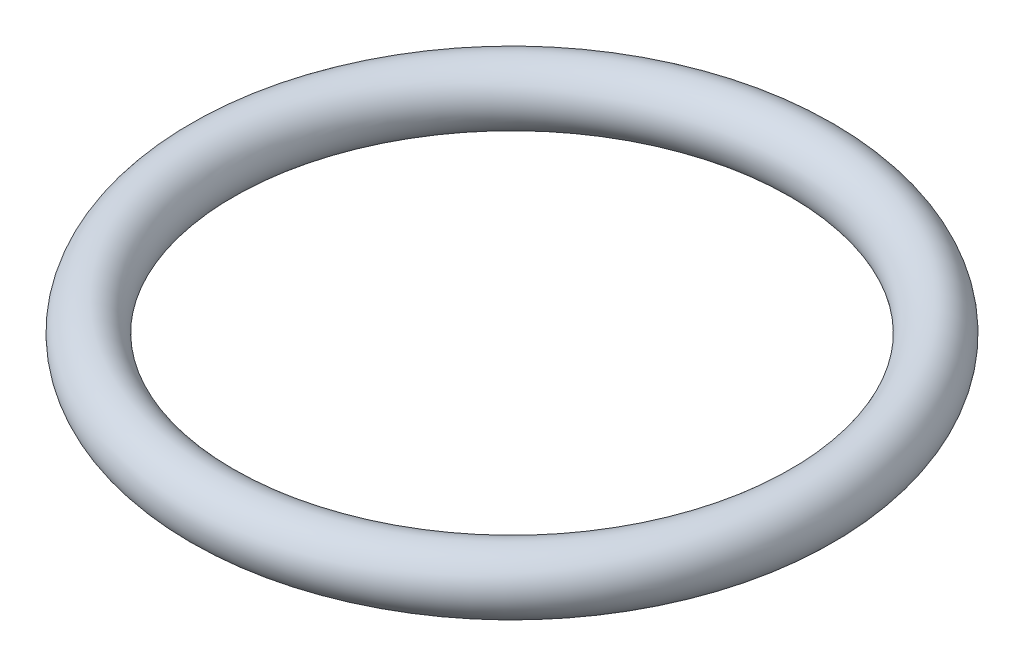
ISO-10303-21;
HEADER;
FILE_DESCRIPTION(('STEP AP214'),'2;1');
FILE_NAME('part.step','',(''),(''),'','','');
FILE_SCHEMA(('AUTOMOTIVE_DESIGN { 1 0 10303 214 1 1 1 1 }'));
ENDSEC;
DATA;
#1=APPLICATION_CONTEXT('core data for automotive mechanical design processes');
#2=APPLICATION_PROTOCOL_DEFINITION('international standard','automotive_design',2000,#1);
#3=PRODUCT_CONTEXT('',#1,'mechanical');
#4=PRODUCT('Part','Part','',(#3));
#5=PRODUCT_RELATED_PRODUCT_CATEGORY('part','',(#4));
#6=PRODUCT_DEFINITION_FORMATION('','',#4);
#7=PRODUCT_DEFINITION_CONTEXT('part definition',#1,'design');
#8=PRODUCT_DEFINITION('design','',#6,#7);
#9=PRODUCT_DEFINITION_SHAPE('','',#8);
#10=(LENGTH_UNIT() NAMED_UNIT(*) SI_UNIT(.MILLI.,.METRE.));
#11=(NAMED_UNIT(*) PLANE_ANGLE_UNIT() SI_UNIT($,.RADIAN.));
#12=(NAMED_UNIT(*) SI_UNIT($,.STERADIAN.) SOLID_ANGLE_UNIT());
#13=UNCERTAINTY_MEASURE_WITH_UNIT(LENGTH_MEASURE(1.E-05),#10,'distance_accuracy_value','');
#14=(GEOMETRIC_REPRESENTATION_CONTEXT(3) GLOBAL_UNCERTAINTY_ASSIGNED_CONTEXT((#13)) GLOBAL_UNIT_ASSIGNED_CONTEXT((#10,
#11,#12)) REPRESENTATION_CONTEXT('',''));
#15=CARTESIAN_POINT('',(0.,0.,0.));
#16=DIRECTION('',(0.,0.,1.));
#17=DIRECTION('',(1.,0.,0.));
#18=AXIS2_PLACEMENT_3D('',#15,#16,#17);
#19=CARTESIAN_POINT('',(0.,-2.736392,0.));
#20=DIRECTION('',(0.,1.,0.));
#21=DIRECTION('',(0.,0.,1.));
#22=AXIS2_PLACEMENT_3D('',#19,#20,#21);
#23=TOROIDAL_SURFACE('',#22,10.,0.999999999999998);
#24=CARTESIAN_POINT('',(0.,-2.736392,11.));
#25=VERTEX_POINT('',#24);
#26=VERTEX_LOOP('',#25);
#27=FACE_BOUND('',#26,.T.);
#28=ADVANCED_FACE('F29',(#27),#23,.T.);
#29=CLOSED_SHELL('',(#28));
#30=MANIFOLD_SOLID_BREP('B2',#29);
#31=ADVANCED_BREP_SHAPE_REPRESENTATION('',(#18,#30),#14);
#32=SHAPE_DEFINITION_REPRESENTATION(#9,#31);
ENDSEC;
END-ISO-10303-21;
